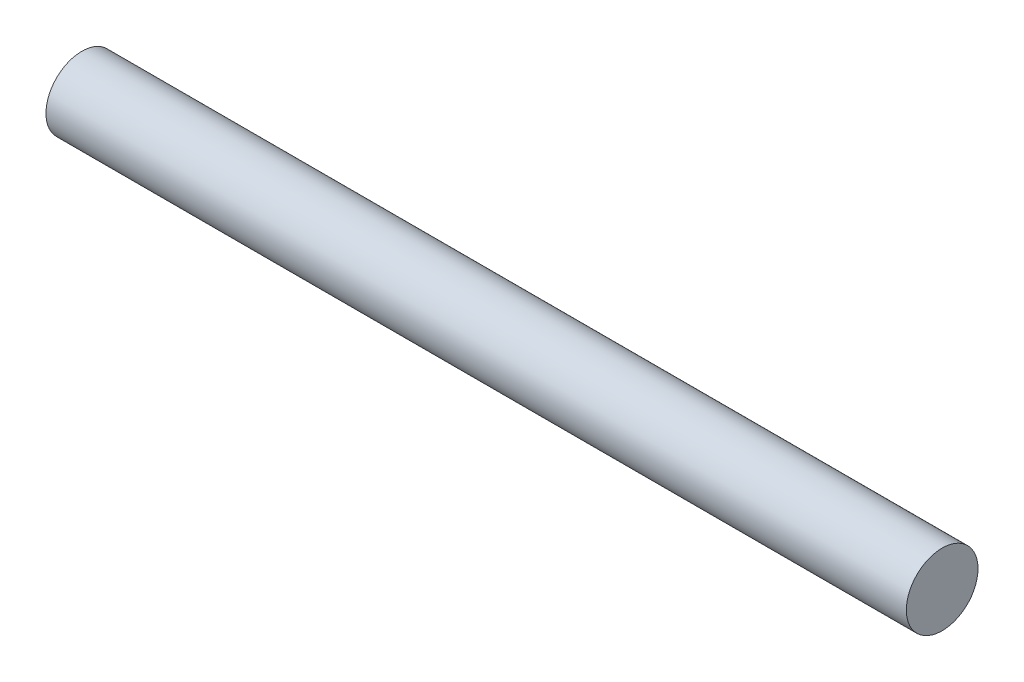
ISO-10303-21;
HEADER;
FILE_DESCRIPTION(('STEP AP214'),'2;1');
FILE_NAME('part.step','',(''),(''),'','','');
FILE_SCHEMA(('AUTOMOTIVE_DESIGN { 1 0 10303 214 1 1 1 1 }'));
ENDSEC;
DATA;
#1=APPLICATION_CONTEXT('core data for automotive mechanical design processes');
#2=APPLICATION_PROTOCOL_DEFINITION('international standard','automotive_design',2000,#1);
#3=PRODUCT_CONTEXT('',#1,'mechanical');
#4=PRODUCT('Part','Part','',(#3));
#5=PRODUCT_RELATED_PRODUCT_CATEGORY('part','',(#4));
#6=PRODUCT_DEFINITION_FORMATION('','',#4);
#7=PRODUCT_DEFINITION_CONTEXT('part definition',#1,'design');
#8=PRODUCT_DEFINITION('design','',#6,#7);
#9=PRODUCT_DEFINITION_SHAPE('','',#8);
#10=(LENGTH_UNIT() NAMED_UNIT(*) SI_UNIT(.MILLI.,.METRE.));
#11=(NAMED_UNIT(*) PLANE_ANGLE_UNIT() SI_UNIT($,.RADIAN.));
#12=(NAMED_UNIT(*) SI_UNIT($,.STERADIAN.) SOLID_ANGLE_UNIT());
#13=UNCERTAINTY_MEASURE_WITH_UNIT(LENGTH_MEASURE(1.E-05),#10,'distance_accuracy_value','');
#14=(GEOMETRIC_REPRESENTATION_CONTEXT(3) GLOBAL_UNCERTAINTY_ASSIGNED_CONTEXT((#13)) GLOBAL_UNIT_ASSIGNED_CONTEXT((#10,
#11,#12)) REPRESENTATION_CONTEXT('',''));
#15=CARTESIAN_POINT('',(0.,0.,0.));
#16=DIRECTION('',(0.,0.,1.));
#17=DIRECTION('',(1.,0.,0.));
#18=AXIS2_PLACEMENT_3D('',#15,#16,#17);
#19=CARTESIAN_POINT('',(19.05,0.,0.));
#20=DIRECTION('',(-1.,0.,0.));
#21=DIRECTION('',(0.,0.,1.));
#22=AXIS2_PLACEMENT_3D('',#19,#20,#21);
#23=CYLINDRICAL_SURFACE('',#22,1.5875);
#24=CARTESIAN_POINT('',(19.05,0.,0.));
#25=DIRECTION('',(1.,0.,0.));
#26=DIRECTION('',(0.,0.,-1.));
#27=AXIS2_PLACEMENT_3D('',#24,#25,#26);
#28=CIRCLE('',#27,1.5875);
#29=CARTESIAN_POINT('',(19.05,0.,-1.5875));
#30=VERTEX_POINT('',#29);
#31=EDGE_CURVE('E10',#30,#30,#28,.T.);
#32=ORIENTED_EDGE('',*,*,#31,.F.);
#33=EDGE_LOOP('',(#32));
#34=FACE_BOUND('',#33,.T.);
#35=CARTESIAN_POINT('',(-19.05,0.,0.));
#36=DIRECTION('',(1.,0.,0.));
#37=DIRECTION('',(0.,0.,-1.));
#38=AXIS2_PLACEMENT_3D('',#35,#36,#37);
#39=CIRCLE('',#38,1.5875);
#40=CARTESIAN_POINT('',(-19.05,0.,-1.5875));
#41=VERTEX_POINT('',#40);
#42=EDGE_CURVE('E34',#41,#41,#39,.T.);
#43=ORIENTED_EDGE('',*,*,#42,.T.);
#44=EDGE_LOOP('',(#43));
#45=FACE_BOUND('',#44,.T.);
#46=ADVANCED_FACE('F31',(#34,#45),#23,.T.);
#47=CARTESIAN_POINT('',(19.05,0.,0.));
#48=DIRECTION('',(1.,0.,0.));
#49=DIRECTION('',(0.,0.,-1.));
#50=AXIS2_PLACEMENT_3D('',#47,#48,#49);
#51=PLANE('',#50);
#52=ORIENTED_EDGE('',*,*,#31,.T.);
#53=EDGE_LOOP('',(#52));
#54=FACE_BOUND('',#53,.T.);
#55=ADVANCED_FACE('F46',(#54),#51,.T.);
#56=CARTESIAN_POINT('',(-19.05,0.,0.));
#57=DIRECTION('',(1.,0.,0.));
#58=DIRECTION('',(0.,0.,-1.));
#59=AXIS2_PLACEMENT_3D('',#56,#57,#58);
#60=PLANE('',#59);
#61=ORIENTED_EDGE('',*,*,#42,.F.);
#62=EDGE_LOOP('',(#61));
#63=FACE_BOUND('',#62,.T.);
#64=ADVANCED_FACE('F44',(#63),#60,.F.);
#65=CLOSED_SHELL('',(#46,#55,#64));
#66=MANIFOLD_SOLID_BREP('B2',#65);
#67=ADVANCED_BREP_SHAPE_REPRESENTATION('',(#18,#66),#14);
#68=SHAPE_DEFINITION_REPRESENTATION(#9,#67);
ENDSEC;
END-ISO-10303-21;
